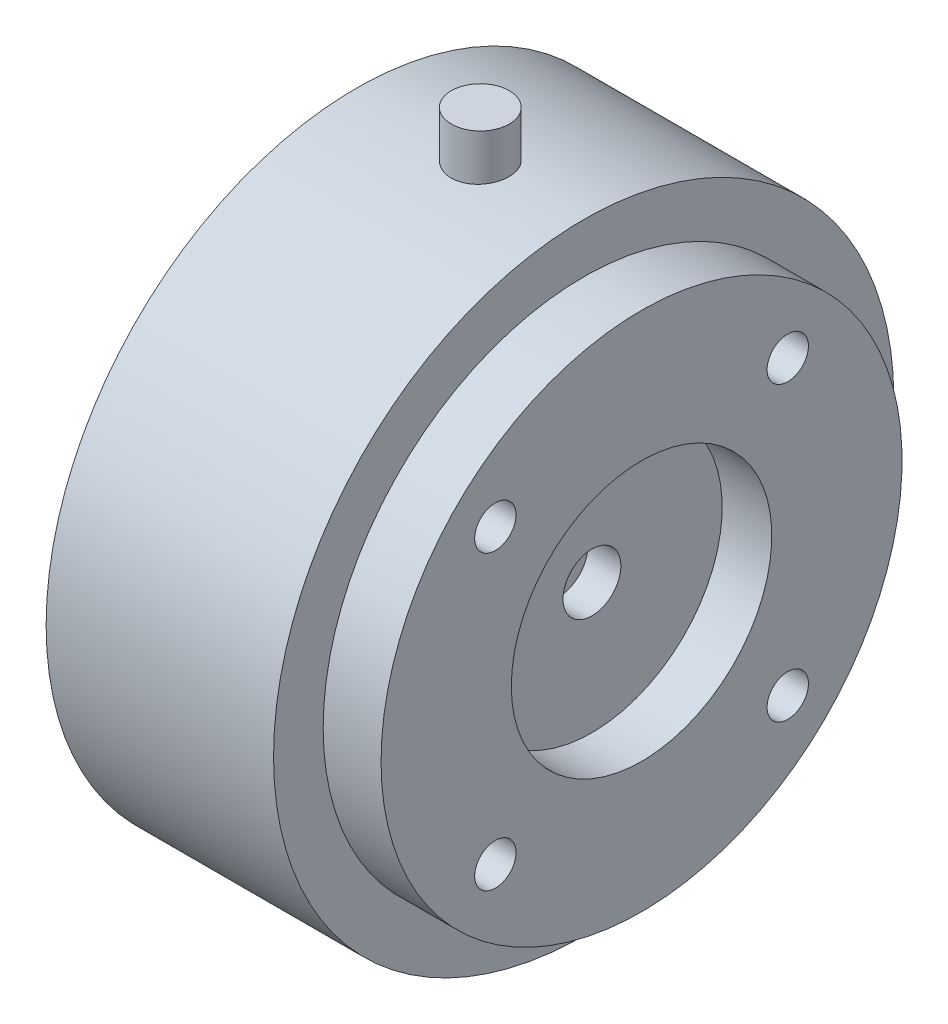
ISO-10303-21;
HEADER;
FILE_DESCRIPTION(('STEP AP214'),'2;1');
FILE_NAME('part.step','',(''),(''),'','','');
FILE_SCHEMA(('AUTOMOTIVE_DESIGN { 1 0 10303 214 1 1 1 1 }'));
ENDSEC;
DATA;
#1=APPLICATION_CONTEXT('core data for automotive mechanical design processes');
#2=APPLICATION_PROTOCOL_DEFINITION('international standard','automotive_design',2000,#1);
#3=PRODUCT_CONTEXT('',#1,'mechanical');
#4=PRODUCT('Part','Part','',(#3));
#5=PRODUCT_RELATED_PRODUCT_CATEGORY('part','',(#4));
#6=PRODUCT_DEFINITION_FORMATION('','',#4);
#7=PRODUCT_DEFINITION_CONTEXT('part definition',#1,'design');
#8=PRODUCT_DEFINITION('design','',#6,#7);
#9=PRODUCT_DEFINITION_SHAPE('','',#8);
#10=(LENGTH_UNIT() NAMED_UNIT(*) SI_UNIT(.MILLI.,.METRE.));
#11=(NAMED_UNIT(*) PLANE_ANGLE_UNIT() SI_UNIT($,.RADIAN.));
#12=(NAMED_UNIT(*) SI_UNIT($,.STERADIAN.) SOLID_ANGLE_UNIT());
#13=UNCERTAINTY_MEASURE_WITH_UNIT(LENGTH_MEASURE(1.E-05),#10,'distance_accuracy_value','');
#14=(GEOMETRIC_REPRESENTATION_CONTEXT(3) GLOBAL_UNCERTAINTY_ASSIGNED_CONTEXT((#13)) GLOBAL_UNIT_ASSIGNED_CONTEXT((#10,
#11,#12)) REPRESENTATION_CONTEXT('',''));
#15=CARTESIAN_POINT('',(0.,0.,0.));
#16=DIRECTION('',(0.,0.,1.));
#17=DIRECTION('',(1.,0.,0.));
#18=AXIS2_PLACEMENT_3D('',#15,#16,#17);
#19=CARTESIAN_POINT('',(15.,43.,0.));
#20=DIRECTION('',(0.,1.,0.));
#21=DIRECTION('',(0.,0.,1.));
#22=AXIS2_PLACEMENT_3D('',#19,#20,#21);
#23=PLANE('',#22);
#24=CARTESIAN_POINT('',(15.,43.,0.));
#25=DIRECTION('',(0.,-1.,0.));
#26=DIRECTION('',(0.,0.,-1.));
#27=AXIS2_PLACEMENT_3D('',#24,#25,#26);
#28=CIRCLE('',#27,3.5);
#29=CARTESIAN_POINT('',(15.,43.,-3.5));
#30=VERTEX_POINT('',#29);
#31=EDGE_CURVE('P0_E16',#30,#30,#28,.T.);
#32=ORIENTED_EDGE('',*,*,#31,.F.);
#33=EDGE_LOOP('',(#32));
#34=FACE_BOUND('',#33,.T.);
#35=ADVANCED_FACE('P0_F13',(#34),#23,.T.);
#36=CARTESIAN_POINT('',(15.,0.,0.));
#37=DIRECTION('',(0.,1.,0.));
#38=DIRECTION('',(0.,0.,1.));
#39=AXIS2_PLACEMENT_3D('',#36,#37,#38);
#40=PLANE('',#39);
#41=CARTESIAN_POINT('',(15.,0.,0.));
#42=DIRECTION('',(0.,-1.,0.));
#43=DIRECTION('',(0.,0.,-1.));
#44=AXIS2_PLACEMENT_3D('',#41,#42,#43);
#45=CIRCLE('',#44,3.5);
#46=CARTESIAN_POINT('',(15.,0.,-3.5));
#47=VERTEX_POINT('',#46);
#48=EDGE_CURVE('P0_E9',#47,#47,#45,.F.);
#49=ORIENTED_EDGE('',*,*,#48,.F.);
#50=EDGE_LOOP('',(#49));
#51=FACE_BOUND('',#50,.T.);
#52=ADVANCED_FACE('P0_F28',(#51),#40,.F.);
#53=CARTESIAN_POINT('',(15.,43.,0.));
#54=DIRECTION('',(0.,-1.,0.));
#55=DIRECTION('',(0.,0.,-1.));
#56=AXIS2_PLACEMENT_3D('',#53,#54,#55);
#57=CYLINDRICAL_SURFACE('',#56,3.5);
#58=ORIENTED_EDGE('',*,*,#48,.T.);
#59=EDGE_LOOP('',(#58));
#60=FACE_BOUND('',#59,.T.);
#61=ORIENTED_EDGE('',*,*,#31,.T.);
#62=EDGE_LOOP('',(#61));
#63=FACE_BOUND('',#62,.T.);
#64=ADVANCED_FACE('P0_F25',(#60,#63),#57,.T.);
#65=CLOSED_SHELL('',(#35,#52,#64));
#66=MANIFOLD_SOLID_BREP('P0_B1',#65);
#67=CARTESIAN_POINT('',(24.5,0.,0.));
#68=DIRECTION('',(1.,0.,0.));
#69=DIRECTION('',(0.,0.,-1.));
#70=AXIS2_PLACEMENT_3D('',#67,#68,#69);
#71=PLANE('',#70);
#72=CARTESIAN_POINT('',(24.5,0.,0.));
#73=DIRECTION('',(1.,0.,0.));
#74=DIRECTION('',(0.,0.,-1.));
#75=AXIS2_PLACEMENT_3D('',#72,#73,#74);
#76=CIRCLE('',#75,3.5);
#77=CARTESIAN_POINT('',(24.5,0.,-3.5));
#78=VERTEX_POINT('',#77);
#79=EDGE_CURVE('P1_E198',#78,#78,#76,.T.);
#80=ORIENTED_EDGE('',*,*,#79,.T.);
#81=EDGE_LOOP('',(#80));
#82=FACE_BOUND('',#81,.T.);
#83=ADVANCED_FACE('P1_F17',(#82),#71,.T.);
#84=CARTESIAN_POINT('',(0.,0.,0.));
#85=DIRECTION('',(1.,0.,0.));
#86=DIRECTION('',(0.,0.,-1.));
#87=AXIS2_PLACEMENT_3D('',#84,#85,#86);
#88=CYLINDRICAL_SURFACE('',#87,3.5);
#89=ORIENTED_EDGE('',*,*,#79,.F.);
#90=EDGE_LOOP('',(#89));
#91=FACE_BOUND('',#90,.T.);
#92=CARTESIAN_POINT('',(28.5,0.,0.));
#93=DIRECTION('',(1.,0.,0.));
#94=DIRECTION('',(0.,0.,-1.));
#95=AXIS2_PLACEMENT_3D('',#92,#93,#94);
#96=CIRCLE('',#95,3.5);
#97=CARTESIAN_POINT('',(28.5,0.,-3.5));
#98=VERTEX_POINT('',#97);
#99=EDGE_CURVE('P1_E85',#98,#98,#96,.T.);
#100=ORIENTED_EDGE('',*,*,#99,.T.);
#101=EDGE_LOOP('',(#100));
#102=FACE_BOUND('',#101,.T.);
#103=ADVANCED_FACE('P1_F188',(#91,#102),#88,.F.);
#104=CARTESIAN_POINT('',(26.4999999999418,-17.6776695296635,-17.6776695296638));
#105=DIRECTION('',(1.,0.,0.));
#106=DIRECTION('',(0.,0.,-1.));
#107=AXIS2_PLACEMENT_3D('',#104,#105,#106);
#108=CONICAL_SURFACE('',#107,2.49999999996645,1.02974425867857);
#109=CARTESIAN_POINT('',(24.9978484524149,-17.6776695296635,-17.6776695296638));
#110=VERTEX_POINT('',#109);
#111=VERTEX_LOOP('',#110);
#112=FACE_BOUND('',#111,.T.);
#113=CARTESIAN_POINT('',(26.5,-17.6776695296635,-17.6776695296638));
#114=DIRECTION('',(1.,0.,0.));
#115=DIRECTION('',(0.,0.,-1.));
#116=AXIS2_PLACEMENT_3D('',#113,#114,#115);
#117=CIRCLE('',#116,2.5);
#118=CARTESIAN_POINT('',(26.5,-17.6776695296635,-20.1776695296638));
#119=VERTEX_POINT('',#118);
#120=EDGE_CURVE('P1_E83',#119,#119,#117,.T.);
#121=ORIENTED_EDGE('',*,*,#120,.T.);
#122=EDGE_LOOP('',(#121));
#123=FACE_BOUND('',#122,.T.);
#124=ADVANCED_FACE('P1_F186',(#112,#123),#108,.F.);
#125=CARTESIAN_POINT('',(26.4999999999986,-17.6776695296638,17.6776695296636));
#126=DIRECTION('',(1.,0.,0.));
#127=DIRECTION('',(0.,1.,0.));
#128=AXIS2_PLACEMENT_3D('',#125,#126,#127);
#129=CONICAL_SURFACE('',#128,2.50000000002875,1.0297442586719);
#130=CARTESIAN_POINT('',(24.9978484524149,-17.6776695296638,17.6776695296636));
#131=VERTEX_POINT('',#130);
#132=VERTEX_LOOP('',#131);
#133=FACE_BOUND('',#132,.T.);
#134=CARTESIAN_POINT('',(26.5,-17.6776695296638,17.6776695296636));
#135=DIRECTION('',(1.,0.,0.));
#136=DIRECTION('',(0.,0.,-1.));
#137=AXIS2_PLACEMENT_3D('',#134,#135,#136);
#138=CIRCLE('',#137,2.5);
#139=CARTESIAN_POINT('',(26.5,-17.6776695296638,15.1776695296636));
#140=VERTEX_POINT('',#139);
#141=EDGE_CURVE('P1_E80',#140,#140,#138,.T.);
#142=ORIENTED_EDGE('',*,*,#141,.T.);
#143=EDGE_LOOP('',(#142));
#144=FACE_BOUND('',#143,.T.);
#145=ADVANCED_FACE('P1_F182',(#133,#144),#129,.F.);
#146=CARTESIAN_POINT('',(26.4999999999986,17.6776695296637,17.6776695296637));
#147=DIRECTION('',(1.,0.,0.));
#148=DIRECTION('',(0.,1.,0.));
#149=AXIS2_PLACEMENT_3D('',#146,#147,#148);
#150=CONICAL_SURFACE('',#149,2.50000000002888,1.0297442586719);
#151=CARTESIAN_POINT('',(24.9978484524149,17.6776695296637,17.6776695296637));
#152=VERTEX_POINT('',#151);
#153=VERTEX_LOOP('',#152);
#154=FACE_BOUND('',#153,.T.);
#155=CARTESIAN_POINT('',(26.5,17.6776695296637,17.6776695296637));
#156=DIRECTION('',(1.,0.,0.));
#157=DIRECTION('',(0.,0.,-1.));
#158=AXIS2_PLACEMENT_3D('',#155,#156,#157);
#159=CIRCLE('',#158,2.5);
#160=CARTESIAN_POINT('',(26.5,17.6776695296637,15.1776695296637));
#161=VERTEX_POINT('',#160);
#162=EDGE_CURVE('P1_E77',#161,#161,#159,.T.);
#163=ORIENTED_EDGE('',*,*,#162,.T.);
#164=EDGE_LOOP('',(#163));
#165=FACE_BOUND('',#164,.T.);
#166=ADVANCED_FACE('P1_F179',(#154,#165),#150,.F.);
#167=CARTESIAN_POINT('',(26.4999999999418,17.6776695296637,-17.6776695296637));
#168=DIRECTION('',(1.,0.,0.));
#169=DIRECTION('',(0.,0.,-1.));
#170=AXIS2_PLACEMENT_3D('',#167,#168,#169);
#171=CONICAL_SURFACE('',#170,2.49999999996657,1.02974425867857);
#172=CARTESIAN_POINT('',(24.9978484524149,17.6776695296637,-17.6776695296637));
#173=VERTEX_POINT('',#172);
#174=VERTEX_LOOP('',#173);
#175=FACE_BOUND('',#174,.T.);
#176=CARTESIAN_POINT('',(26.5,17.6776695296637,-17.6776695296637));
#177=DIRECTION('',(1.,0.,0.));
#178=DIRECTION('',(0.,0.,-1.));
#179=AXIS2_PLACEMENT_3D('',#176,#177,#178);
#180=CIRCLE('',#179,2.5);
#181=CARTESIAN_POINT('',(26.5,17.6776695296637,-20.1776695296637));
#182=VERTEX_POINT('',#181);
#183=EDGE_CURVE('P1_E73',#182,#182,#180,.T.);
#184=ORIENTED_EDGE('',*,*,#183,.T.);
#185=EDGE_LOOP('',(#184));
#186=FACE_BOUND('',#185,.T.);
#187=ADVANCED_FACE('P1_F175',(#175,#186),#171,.F.);
#188=CARTESIAN_POINT('',(28.5,15.75,0.));
#189=DIRECTION('',(-1.,0.,0.));
#190=DIRECTION('',(0.,0.,1.));
#191=AXIS2_PLACEMENT_3D('',#188,#189,#190);
#192=PLANE('',#191);
#193=CARTESIAN_POINT('',(28.5,0.,0.));
#194=DIRECTION('',(-1.,0.,0.));
#195=DIRECTION('',(0.,0.,1.));
#196=AXIS2_PLACEMENT_3D('',#193,#194,#195);
#197=CIRCLE('',#196,15.75);
#198=CARTESIAN_POINT('',(28.5,0.,15.75));
#199=VERTEX_POINT('',#198);
#200=EDGE_CURVE('P1_E76',#199,#199,#197,.F.);
#201=ORIENTED_EDGE('',*,*,#200,.T.);
#202=EDGE_LOOP('',(#201));
#203=FACE_BOUND('',#202,.T.);
#204=ORIENTED_EDGE('',*,*,#99,.F.);
#205=EDGE_LOOP('',(#204));
#206=FACE_BOUND('',#205,.T.);
#207=ADVANCED_FACE('P1_F171',(#203,#206),#192,.F.);
#208=CARTESIAN_POINT('',(34.5,-17.6776695296635,-17.6776695296638));
#209=DIRECTION('',(1.,0.,0.));
#210=DIRECTION('',(0.,0.,-1.));
#211=AXIS2_PLACEMENT_3D('',#208,#209,#210);
#212=CYLINDRICAL_SURFACE('',#211,2.5);
#213=ORIENTED_EDGE('',*,*,#120,.F.);
#214=EDGE_LOOP('',(#213));
#215=FACE_BOUND('',#214,.T.);
#216=CARTESIAN_POINT('',(34.5,-17.6776695296635,-17.6776695296638));
#217=DIRECTION('',(1.,0.,0.));
#218=DIRECTION('',(0.,0.,-1.));
#219=AXIS2_PLACEMENT_3D('',#216,#217,#218);
#220=CIRCLE('',#219,2.5);
#221=CARTESIAN_POINT('',(34.5,-17.6776695296635,-20.1776695296638));
#222=VERTEX_POINT('',#221);
#223=EDGE_CURVE('P1_E396',#222,#222,#220,.T.);
#224=ORIENTED_EDGE('',*,*,#223,.T.);
#225=EDGE_LOOP('',(#224));
#226=FACE_BOUND('',#225,.T.);
#227=ADVANCED_FACE('P1_F167',(#215,#226),#212,.F.);
#228=CARTESIAN_POINT('',(34.5,-17.6776695296638,17.6776695296636));
#229=DIRECTION('',(1.,0.,0.));
#230=DIRECTION('',(0.,0.,-1.));
#231=AXIS2_PLACEMENT_3D('',#228,#229,#230);
#232=CYLINDRICAL_SURFACE('',#231,2.5);
#233=ORIENTED_EDGE('',*,*,#141,.F.);
#234=EDGE_LOOP('',(#233));
#235=FACE_BOUND('',#234,.T.);
#236=CARTESIAN_POINT('',(34.5,-17.6776695296638,17.6776695296636));
#237=DIRECTION('',(1.,0.,0.));
#238=DIRECTION('',(0.,0.,-1.));
#239=AXIS2_PLACEMENT_3D('',#236,#237,#238);
#240=CIRCLE('',#239,2.5);
#241=CARTESIAN_POINT('',(34.5,-17.6776695296638,15.1776695296636));
#242=VERTEX_POINT('',#241);
#243=EDGE_CURVE('P1_E393',#242,#242,#240,.T.);
#244=ORIENTED_EDGE('',*,*,#243,.T.);
#245=EDGE_LOOP('',(#244));
#246=FACE_BOUND('',#245,.T.);
#247=ADVANCED_FACE('P1_F163',(#235,#246),#232,.F.);
#248=CARTESIAN_POINT('',(34.5,17.6776695296637,17.6776695296637));
#249=DIRECTION('',(1.,0.,0.));
#250=DIRECTION('',(0.,0.,-1.));
#251=AXIS2_PLACEMENT_3D('',#248,#249,#250);
#252=CYLINDRICAL_SURFACE('',#251,2.5);
#253=ORIENTED_EDGE('',*,*,#162,.F.);
#254=EDGE_LOOP('',(#253));
#255=FACE_BOUND('',#254,.T.);
#256=CARTESIAN_POINT('',(34.5,17.6776695296637,17.6776695296637));
#257=DIRECTION('',(1.,0.,0.));
#258=DIRECTION('',(0.,0.,-1.));
#259=AXIS2_PLACEMENT_3D('',#256,#257,#258);
#260=CIRCLE('',#259,2.5);
#261=CARTESIAN_POINT('',(34.5,17.6776695296637,15.1776695296637));
#262=VERTEX_POINT('',#261);
#263=EDGE_CURVE('P1_E389',#262,#262,#260,.T.);
#264=ORIENTED_EDGE('',*,*,#263,.T.);
#265=EDGE_LOOP('',(#264));
#266=FACE_BOUND('',#265,.T.);
#267=ADVANCED_FACE('P1_F159',(#255,#266),#252,.F.);
#268=CARTESIAN_POINT('',(34.5,17.6776695296637,-17.6776695296637));
#269=DIRECTION('',(1.,0.,0.));
#270=DIRECTION('',(0.,0.,-1.));
#271=AXIS2_PLACEMENT_3D('',#268,#269,#270);
#272=CYLINDRICAL_SURFACE('',#271,2.5);
#273=ORIENTED_EDGE('',*,*,#183,.F.);
#274=EDGE_LOOP('',(#273));
#275=FACE_BOUND('',#274,.T.);
#276=CARTESIAN_POINT('',(34.5,17.6776695296637,-17.6776695296637));
#277=DIRECTION('',(1.,0.,0.));
#278=DIRECTION('',(0.,0.,-1.));
#279=AXIS2_PLACEMENT_3D('',#276,#277,#278);
#280=CIRCLE('',#279,2.5);
#281=CARTESIAN_POINT('',(34.5,17.6776695296637,-20.1776695296637));
#282=VERTEX_POINT('',#281);
#283=EDGE_CURVE('P1_E385',#282,#282,#280,.T.);
#284=ORIENTED_EDGE('',*,*,#283,.T.);
#285=EDGE_LOOP('',(#284));
#286=FACE_BOUND('',#285,.T.);
#287=ADVANCED_FACE('P1_F155',(#275,#286),#272,.F.);
#288=CARTESIAN_POINT('',(0.,0.,0.));
#289=DIRECTION('',(-1.,0.,0.));
#290=DIRECTION('',(0.,0.,1.));
#291=AXIS2_PLACEMENT_3D('',#288,#289,#290);
#292=CYLINDRICAL_SURFACE('',#291,15.75);
#293=CARTESIAN_POINT('',(34.5,0.,0.));
#294=DIRECTION('',(-1.,0.,0.));
#295=DIRECTION('',(0.,0.,1.));
#296=AXIS2_PLACEMENT_3D('',#293,#294,#295);
#297=CIRCLE('',#296,15.75);
#298=CARTESIAN_POINT('',(34.5,0.,15.75));
#299=VERTEX_POINT('',#298);
#300=EDGE_CURVE('P1_E138',#299,#299,#297,.F.);
#301=ORIENTED_EDGE('',*,*,#300,.T.);
#302=EDGE_LOOP('',(#301));
#303=FACE_BOUND('',#302,.T.);
#304=ORIENTED_EDGE('',*,*,#200,.F.);
#305=EDGE_LOOP('',(#304));
#306=FACE_BOUND('',#305,.T.);
#307=ADVANCED_FACE('P1_F151',(#303,#306),#292,.F.);
#308=CARTESIAN_POINT('',(34.5,31.5,0.));
#309=DIRECTION('',(-1.,0.,0.));
#310=DIRECTION('',(0.,0.,1.));
#311=AXIS2_PLACEMENT_3D('',#308,#309,#310);
#312=PLANE('',#311);
#313=ORIENTED_EDGE('',*,*,#300,.F.);
#314=EDGE_LOOP('',(#313));
#315=FACE_BOUND('',#314,.T.);
#316=CARTESIAN_POINT('',(34.5,0.,0.));
#317=DIRECTION('',(-1.,0.,0.));
#318=DIRECTION('',(0.,0.,1.));
#319=AXIS2_PLACEMENT_3D('',#316,#317,#318);
#320=CIRCLE('',#319,31.5);
#321=CARTESIAN_POINT('',(34.5,0.,31.5));
#322=VERTEX_POINT('',#321);
#323=EDGE_CURVE('P1_E135',#322,#322,#320,.T.);
#324=ORIENTED_EDGE('',*,*,#323,.F.);
#325=EDGE_LOOP('',(#324));
#326=FACE_BOUND('',#325,.T.);
#327=ORIENTED_EDGE('',*,*,#283,.F.);
#328=EDGE_LOOP('',(#327));
#329=FACE_BOUND('',#328,.T.);
#330=ORIENTED_EDGE('',*,*,#263,.F.);
#331=EDGE_LOOP('',(#330));
#332=FACE_BOUND('',#331,.T.);
#333=ORIENTED_EDGE('',*,*,#243,.F.);
#334=EDGE_LOOP('',(#333));
#335=FACE_BOUND('',#334,.T.);
#336=ORIENTED_EDGE('',*,*,#223,.F.);
#337=EDGE_LOOP('',(#336));
#338=FACE_BOUND('',#337,.T.);
#339=ADVANCED_FACE('P1_F148',(#315,#326,#329,#332,#335,#338),#312,.F.);
#340=CARTESIAN_POINT('',(110.767027304759,0.,0.));
#341=DIRECTION('',(-1.,0.,0.));
#342=DIRECTION('',(0.,0.,1.));
#343=AXIS2_PLACEMENT_3D('',#340,#341,#342);
#344=CYLINDRICAL_SURFACE('',#343,30.5);
#345=CARTESIAN_POINT('',(15.,30.2985148150862,3.5));
#346=CARTESIAN_POINT('',(15.1957241918327,30.298517378201,3.49999145726934));
#347=CARTESIAN_POINT('',(15.391706129943,30.3004332540409,3.48351415691752));
#348=CARTESIAN_POINT('',(15.7783592301681,30.3078916885357,3.41800360986984));
#349=CARTESIAN_POINT('',(15.9690184270781,30.3134418242641,3.3689023422705));
#350=CARTESIAN_POINT('',(16.3391717964097,30.3275322944483,3.23959657868739));
#351=CARTESIAN_POINT('',(16.5186773197242,30.3360695282893,3.15942432520621));
#352=CARTESIAN_POINT('',(16.8616010791098,30.3551677477307,2.97031612135552));
#353=CARTESIAN_POINT('',(17.0250261007644,30.3657278741277,2.86139237549709));
#354=CARTESIAN_POINT('',(17.3320316611392,30.3877407639857,2.61729800992369));
#355=CARTESIAN_POINT('',(17.4755233500652,30.3991971892655,2.48201595110769));
#356=CARTESIAN_POINT('',(17.737825696396,30.4216792291987,2.18927848624548));
#357=CARTESIAN_POINT('',(17.856633951149,30.4327048018289,2.03182092416669));
#358=CARTESIAN_POINT('',(18.066493529691,30.4531181691266,1.69866981088559));
#359=CARTESIAN_POINT('',(18.1574674419035,30.4625013656716,1.52292719050938));
#360=CARTESIAN_POINT('',(18.3085792035095,30.4785337357317,1.15853524249233));
#361=CARTESIAN_POINT('',(18.3687182945705,30.4851830193348,0.969886434909223));
#362=CARTESIAN_POINT('',(18.4561968809372,30.4949733208849,0.585919982397345));
#363=CARTESIAN_POINT('',(18.483680109644,30.498129708417,0.390635482220919));
#364=CARTESIAN_POINT('',(18.5055119415603,30.5006309800531,-0.00179814922138461));
#365=CARTESIAN_POINT('',(18.4998615965257,30.4999759851414,-0.198947221102005));
#366=CARTESIAN_POINT('',(18.4557026022766,30.4949407964535,-0.588534530467278));
#367=CARTESIAN_POINT('',(18.4173488190871,30.4905781604075,-0.780990580505136));
#368=CARTESIAN_POINT('',(18.309112802447,30.4786377272088,-1.15671787386288));
#369=CARTESIAN_POINT('',(18.2392297691636,30.4710598484922,-1.33998888404597));
#370=CARTESIAN_POINT('',(18.0697493194626,30.4535100495338,-1.69263095242608));
#371=CARTESIAN_POINT('',(17.970083223773,30.4435326064287,-1.86196871705035));
#372=CARTESIAN_POINT('',(17.7439244415839,30.42230250347,-2.18155900020481));
#373=CARTESIAN_POINT('',(17.6174329078279,30.4110498984224,-2.33181233838803));
#374=CARTESIAN_POINT('',(17.3403704070089,30.3884551454816,-2.60986627331945));
#375=CARTESIAN_POINT('',(17.1896691856529,30.3771128480346,-2.73753708685216));
#376=CARTESIAN_POINT('',(16.8688244322086,30.3556737708395,-2.96585046369139));
#377=CARTESIAN_POINT('',(16.6986719939111,30.3455775660804,-3.06648057453254));
#378=CARTESIAN_POINT('',(16.3436015709479,30.3277726662424,-3.23784902247358));
#379=CARTESIAN_POINT('',(16.1586669763757,30.320066705763,-3.30855315570503));
#380=CARTESIAN_POINT('',(15.7796931406874,30.3079568417157,-3.41772073943064));
#381=CARTESIAN_POINT('',(15.5856741279069,30.3035459409147,-3.45625253020592));
#382=CARTESIAN_POINT('',(15.3252842170865,30.3001908899848,-3.48546347914347));
#383=CARTESIAN_POINT('',(15.260356316206,30.2995636448211,-3.49091060261971));
#384=CARTESIAN_POINT('',(15.1302951331559,30.2987251806388,-3.49818028569412));
#385=CARTESIAN_POINT('',(15.0651618509191,30.2985139617564,-3.50000284410494));
#386=CARTESIAN_POINT('',(14.8042758081673,30.298517378201,-3.49999145726934));
#387=CARTESIAN_POINT('',(14.608293870057,30.3004332540409,-3.48351415691752));
#388=CARTESIAN_POINT('',(14.2216407698319,30.3078916885357,-3.41800360986984));
#389=CARTESIAN_POINT('',(14.0309815729219,30.3134418242641,-3.3689023422705));
#390=CARTESIAN_POINT('',(13.6608282035903,30.3275322944483,-3.23959657868739));
#391=CARTESIAN_POINT('',(13.4813226802758,30.3360695282893,-3.15942432520621));
#392=CARTESIAN_POINT('',(13.1383989208902,30.3551677477307,-2.97031612135552));
#393=CARTESIAN_POINT('',(12.9749738992356,30.3657278741277,-2.86139237549709));
#394=CARTESIAN_POINT('',(12.6679683388608,30.3877407639857,-2.61729800992369));
#395=CARTESIAN_POINT('',(12.5244766499348,30.3991971892655,-2.48201595110769));
#396=CARTESIAN_POINT('',(12.262174303604,30.4216792291987,-2.18927848624548));
#397=CARTESIAN_POINT('',(12.143366048851,30.4327048018289,-2.03182092416668));
#398=CARTESIAN_POINT('',(11.933506470309,30.4531181691266,-1.69866981088558));
#399=CARTESIAN_POINT('',(11.8425325580965,30.4625013656716,-1.52292719050938));
#400=CARTESIAN_POINT('',(11.6914207964905,30.4785337357317,-1.15853524249233));
#401=CARTESIAN_POINT('',(11.6312817054295,30.4851830193348,-0.969886434909219));
#402=CARTESIAN_POINT('',(11.5438031190628,30.4949733208849,-0.58591998239734));
#403=CARTESIAN_POINT('',(11.516319890356,30.498129708417,-0.390635482220916));
#404=CARTESIAN_POINT('',(11.4944880584397,30.5006309800531,0.00179814922138805));
#405=CARTESIAN_POINT('',(11.5001384034743,30.4999759851414,0.198947221102009));
#406=CARTESIAN_POINT('',(11.5442973977234,30.4949407964535,0.588534530467283));
#407=CARTESIAN_POINT('',(11.5826511809129,30.4905781604075,0.780990580505141));
#408=CARTESIAN_POINT('',(11.690887197553,30.4786377272088,1.15671787386288));
#409=CARTESIAN_POINT('',(11.7607702308364,30.4710598484922,1.33998888404597));
#410=CARTESIAN_POINT('',(11.9302506805374,30.4535100495338,1.69263095242609));
#411=CARTESIAN_POINT('',(12.029916776227,30.4435326064287,1.86196871705036));
#412=CARTESIAN_POINT('',(12.2560755584161,30.42230250347,2.18155900020481));
#413=CARTESIAN_POINT('',(12.3825670921721,30.4110498984224,2.33181233838803));
#414=CARTESIAN_POINT('',(12.6596295929911,30.3884551454816,2.60986627331945));
#415=CARTESIAN_POINT('',(12.8103308143471,30.3771128480346,2.73753708685217));
#416=CARTESIAN_POINT('',(13.1311755677914,30.3556737708395,2.96585046369139));
#417=CARTESIAN_POINT('',(13.3013280060889,30.3455775660804,3.06648057453255));
#418=CARTESIAN_POINT('',(13.6563984290521,30.3277726662424,3.23784902247358));
#419=CARTESIAN_POINT('',(13.8413330236243,30.320066705763,3.30855315570503));
#420=CARTESIAN_POINT('',(14.2203068593126,30.3079568417157,3.41772073943064));
#421=CARTESIAN_POINT('',(14.4143258720931,30.3035459409147,3.45625253020592));
#422=CARTESIAN_POINT('',(14.6747157829135,30.3001908899848,3.48546347914347));
#423=CARTESIAN_POINT('',(14.739643683794,30.2995636448211,3.49091060261971));
#424=CARTESIAN_POINT('',(14.8697048668441,30.2987251806388,3.49818028569412));
#425=CARTESIAN_POINT('',(14.9348381490809,30.2985139617564,3.50000284410494));
#426=CARTESIAN_POINT('',(15.,30.2985148150862,3.5));
#427=B_SPLINE_CURVE_WITH_KNOTS('',3,(#345,#346,#347,#348,#349,#350,#351,#352,#353,#354,#355,
#356,#357,#358,#359,#360,#361,#362,#363,#364,#365,#366,#367,#368,#369,#370,#371,#372,#373,#374,
#375,#376,#377,#378,#379,#380,#381,#382,#383,#384,#385,#386,#387,#388,#389,#390,#391,#392,#393,
#394,#395,#396,#397,#398,#399,#400,#401,#402,#403,#404,#405,#406,#407,#408,#409,#410,#411,#412,
#413,#414,#415,#416,#417,#418,#419,#420,#421,#422,#423,#424,#425,#426),.UNSPECIFIED.,.T.,.F.,(4,
2,2,2,2,2,2,2,2,2,2,2,2,2,2,2,2,2,2,2,2,2,2,2,2,2,2,2,2,2,2,2,2,2,2,2,2,2,2,2,4),(0.,
0.586924300188882,1.17507619265082,1.76261938441853,2.34991357422254,2.93974685655111,
3.52963752557404,4.12115416296189,4.71264697907599,5.301526605123,5.89038753852025,
6.47647532939776,7.06257798896397,7.65004276072638,8.2374822930495,8.82819532080954,
9.41917991237897,10.010838157074,10.6012363845076,10.7966392157223,10.9920421109474,
11.5789664111363,12.1671183035983,12.754661495366,13.34195568517,13.9317889674986,
14.5216796365215,15.1131962739093,15.7046890900234,16.2935687160704,16.8824296494677,
17.4685174403452,18.0546200999114,18.6420848716738,19.229524403997,19.820237431757,
20.4112220233264,21.0028802680215,21.593278495455,21.7886813266698,21.9840842218949),.UNSPECIFIED.);
#428=CARTESIAN_POINT('',(15.,30.2985148150862,3.5));
#429=VERTEX_POINT('',#428);
#430=EDGE_CURVE('P1_E133',#429,#429,#427,.T.);
#431=ORIENTED_EDGE('',*,*,#430,.T.);
#432=EDGE_LOOP('',(#431));
#433=FACE_BOUND('',#432,.T.);
#434=ADVANCED_FACE('P1_F144',(#433),#344,.T.);
#435=CARTESIAN_POINT('',(0.,0.,0.));
#436=DIRECTION('',(-1.,0.,0.));
#437=DIRECTION('',(0.,0.,1.));
#438=AXIS2_PLACEMENT_3D('',#435,#436,#437);
#439=CYLINDRICAL_SURFACE('',#438,31.5);
#440=CARTESIAN_POINT('',(27.5,0.,0.));
#441=DIRECTION('',(-1.,0.,0.));
#442=DIRECTION('',(0.,0.,1.));
#443=AXIS2_PLACEMENT_3D('',#440,#441,#442);
#444=CIRCLE('',#443,31.5);
#445=CARTESIAN_POINT('',(27.5,0.,31.5));
#446=VERTEX_POINT('',#445);
#447=EDGE_CURVE('P1_E96',#446,#446,#444,.F.);
#448=ORIENTED_EDGE('',*,*,#447,.T.);
#449=EDGE_LOOP('',(#448));
#450=FACE_BOUND('',#449,.T.);
#451=ORIENTED_EDGE('',*,*,#323,.T.);
#452=EDGE_LOOP('',(#451));
#453=FACE_BOUND('',#452,.T.);
#454=ADVANCED_FACE('P1_F116',(#450,#453),#439,.T.);
#455=CARTESIAN_POINT('',(15.,37.5,0.));
#456=DIRECTION('',(0.,-1.,0.));
#457=DIRECTION('',(0.,0.,-1.));
#458=AXIS2_PLACEMENT_3D('',#455,#456,#457);
#459=CYLINDRICAL_SURFACE('',#458,3.5);
#460=CARTESIAN_POINT('',(15.,37.3363094051889,-3.5));
#461=CARTESIAN_POINT('',(15.1959643453164,37.3363114581779,-3.49999159976147));
#462=CARTESIAN_POINT('',(15.3921891489186,37.3378699743436,-3.48347414309542));
#463=CARTESIAN_POINT('',(15.7793337680521,37.3439381541415,-3.41779635529493));
#464=CARTESIAN_POINT('',(15.9702415229039,37.3484540346556,-3.36856725553234));
#465=CARTESIAN_POINT('',(16.3408952418815,37.3599213532937,-3.23890177151375));
#466=CARTESIAN_POINT('',(16.5206518150099,37.3668704333545,-3.1584955935267));
#467=CARTESIAN_POINT('',(16.864029437843,37.3824176383386,-2.96881481261273));
#468=CARTESIAN_POINT('',(17.0276575581212,37.3910150357417,-2.85955293776334));
#469=CARTESIAN_POINT('',(17.3347650593464,37.4089230033886,-2.61486659417071));
#470=CARTESIAN_POINT('',(17.4781841383579,37.4182355850682,-2.47936657463364));
#471=CARTESIAN_POINT('',(17.7402867663997,37.4365066736323,-2.1862053535238));
#472=CARTESIAN_POINT('',(17.8589680039185,37.4454651473656,-2.02854208331272));
#473=CARTESIAN_POINT('',(18.0684144585565,37.4620368979857,-1.69518417705755));
#474=CARTESIAN_POINT('',(18.1591289895445,37.4696477219285,-1.51945756287206));
#475=CARTESIAN_POINT('',(18.3097415868075,37.482645682227,-1.15518511728849));
#476=CARTESIAN_POINT('',(18.3696405836016,37.4880328857272,-0.966639673167981));
#477=CARTESIAN_POINT('',(18.4567531338866,37.4959630819518,-0.582666348263732));
#478=CARTESIAN_POINT('',(18.4840619485078,37.4985143625747,-0.38726025339446));
#479=CARTESIAN_POINT('',(18.5055135565062,37.5005134027287,0.00537773248790243));
#480=CARTESIAN_POINT('',(18.4996570485392,37.4999612276368,0.202609584952463));
#481=CARTESIAN_POINT('',(18.4550219248546,37.4958223841303,0.592651845396379));
#482=CARTESIAN_POINT('',(18.4163460460606,37.4922451852938,0.785474124760557));
#483=CARTESIAN_POINT('',(18.3073293548359,37.4824692916633,1.16188026092169));
#484=CARTESIAN_POINT('',(18.2369878867867,37.4762705425918,1.34546392635076));
#485=CARTESIAN_POINT('',(18.066520528893,37.4619321209238,1.69851073715258));
#486=CARTESIAN_POINT('',(17.9663479266554,37.4537894082822,1.86795119902822));
#487=CARTESIAN_POINT('',(17.7391046818286,37.4364782470949,2.18763883602489));
#488=CARTESIAN_POINT('',(17.612035585883,37.4273098575436,2.33788711396824));
#489=CARTESIAN_POINT('',(17.3340538177107,37.4089367108281,2.61551577028369));
#490=CARTESIAN_POINT('',(17.183056454083,37.3997319422155,2.74281135319781));
#491=CARTESIAN_POINT('',(16.8617075323251,37.3823522474711,2.97032126317762));
#492=CARTESIAN_POINT('',(16.6913470280778,37.3741778010752,3.07052299956905));
#493=CARTESIAN_POINT('',(16.3360008786559,37.359782587258,3.240987496695));
#494=CARTESIAN_POINT('',(16.1510008639054,37.3535637699405,3.31122039801249));
#495=CARTESIAN_POINT('',(15.7720166993381,37.3438123278045,3.41945593530299));
#496=CARTESIAN_POINT('',(15.5780525475599,37.3402740034854,3.45752697663121));
#497=CARTESIAN_POINT('',(15.3190028707598,37.3376175073627,3.48602054515327));
#498=CARTESIAN_POINT('',(15.2553235097574,37.3371279469485,3.49125901470397));
#499=CARTESIAN_POINT('',(15.1277719971511,37.3364735611131,3.49825011202207));
#500=CARTESIAN_POINT('',(15.0638998455113,37.3363087357525,3.50000273914085));
#501=CARTESIAN_POINT('',(14.8040356546836,37.3363114581779,3.49999159976147));
#502=CARTESIAN_POINT('',(14.6078108510814,37.3378699743436,3.48347414309542));
#503=CARTESIAN_POINT('',(14.2206662319479,37.3439381541415,3.41779635529493));
#504=CARTESIAN_POINT('',(14.0297584770961,37.3484540346556,3.36856725553234));
#505=CARTESIAN_POINT('',(13.6591047581185,37.3599213532937,3.23890177151375));
#506=CARTESIAN_POINT('',(13.4793481849901,37.3668704333545,3.1584955935267));
#507=CARTESIAN_POINT('',(13.135970562157,37.3824176383386,2.96881481261273));
#508=CARTESIAN_POINT('',(12.9723424418788,37.3910150357417,2.85955293776334));
#509=CARTESIAN_POINT('',(12.6652349406536,37.4089230033886,2.61486659417071));
#510=CARTESIAN_POINT('',(12.5218158616421,37.4182355850682,2.47936657463364));
#511=CARTESIAN_POINT('',(12.2597132336003,37.4365066736323,2.1862053535238));
#512=CARTESIAN_POINT('',(12.1410319960815,37.4454651473656,2.02854208331272));
#513=CARTESIAN_POINT('',(11.9315855414435,37.4620368979857,1.69518417705755));
#514=CARTESIAN_POINT('',(11.8408710104555,37.4696477219284,1.51945756287206));
#515=CARTESIAN_POINT('',(11.6902584131925,37.482645682227,1.15518511728848));
#516=CARTESIAN_POINT('',(11.6303594163984,37.4880328857272,0.966639673167978));
#517=CARTESIAN_POINT('',(11.5432468661134,37.4959630819518,0.58266634826373));
#518=CARTESIAN_POINT('',(11.5159380514922,37.4985143625747,0.387260253394458));
#519=CARTESIAN_POINT('',(11.4944864434938,37.5005134027287,-0.00537773248790338));
#520=CARTESIAN_POINT('',(11.5003429514608,37.4999612276368,-0.202609584952464));
#521=CARTESIAN_POINT('',(11.5449780751454,37.4958223841303,-0.59265184539638));
#522=CARTESIAN_POINT('',(11.5836539539394,37.4922451852938,-0.785474124760559));
#523=CARTESIAN_POINT('',(11.6926706451641,37.4824692916633,-1.16188026092169));
#524=CARTESIAN_POINT('',(11.7630121132133,37.4762705425918,-1.34546392635076));
#525=CARTESIAN_POINT('',(11.933479471107,37.4619321209238,-1.69851073715258));
#526=CARTESIAN_POINT('',(12.0336520733446,37.4537894082822,-1.86795119902822));
#527=CARTESIAN_POINT('',(12.2608953181714,37.4364782470949,-2.1876388360249));
#528=CARTESIAN_POINT('',(12.387964414117,37.4273098575436,-2.33788711396824));
#529=CARTESIAN_POINT('',(12.6659461822893,37.4089367108281,-2.61551577028369));
#530=CARTESIAN_POINT('',(12.816943545917,37.3997319422155,-2.74281135319781));
#531=CARTESIAN_POINT('',(13.1382924676749,37.3823522474711,-2.97032126317762));
#532=CARTESIAN_POINT('',(13.3086529719222,37.3741778010752,-3.07052299956905));
#533=CARTESIAN_POINT('',(13.6639991213441,37.359782587258,-3.240987496695));
#534=CARTESIAN_POINT('',(13.8489991360946,37.3535637699405,-3.3112203980125));
#535=CARTESIAN_POINT('',(14.2279833006619,37.3438123278045,-3.419455935303));
#536=CARTESIAN_POINT('',(14.4219474524401,37.3402740034854,-3.45752697663121));
#537=CARTESIAN_POINT('',(14.6809971292402,37.3376175073627,-3.48602054515327));
#538=CARTESIAN_POINT('',(14.7446764902426,37.3371279469485,-3.49125901470397));
#539=CARTESIAN_POINT('',(14.8722280028489,37.3364735611131,-3.49825011202207));
#540=CARTESIAN_POINT('',(14.9361001544887,37.3363087357525,-3.50000273914085));
#541=CARTESIAN_POINT('',(15.,37.3363094051889,-3.5));
#542=B_SPLINE_CURVE_WITH_KNOTS('',3,(#460,#461,#462,#463,#464,#465,#466,#467,#468,#469,#470,
#471,#472,#473,#474,#475,#476,#477,#478,#479,#480,#481,#482,#483,#484,#485,#486,#487,#488,#489,
#490,#491,#492,#493,#494,#495,#496,#497,#498,#499,#500,#501,#502,#503,#504,#505,#506,#507,#508,
#509,#510,#511,#512,#513,#514,#515,#516,#517,#518,#519,#520,#521,#522,#523,#524,#525,#526,#527,
#528,#529,#530,#531,#532,#533,#534,#535,#536,#537,#538,#539,#540,#541),.UNSPECIFIED.,.T.,.F.,(4,
2,2,2,2,2,2,2,2,2,2,2,2,2,2,2,2,2,2,2,2,2,2,2,2,2,2,2,2,2,2,2,2,2,2,2,2,2,2,2,4),(0.,
0.587649724148832,1.17653877041978,1.76485868472882,2.35291952676917,2.94269952541401,
3.53253460860344,4.12343249304262,4.71431253342716,5.30346116721982,5.89259739013868,
6.47989617052856,7.06720711117352,7.65544259808875,8.24364426856451,8.83397632780462,
9.42458224827804,10.01577525205,10.60570765334,10.7973278153648,10.9889480130453,
11.5765977371941,12.165486783465,12.7538066977741,13.3418675398144,13.9316475384593,
14.5214826216487,15.1123805060879,15.7032605464724,16.2924091802651,16.8815454031839,
17.4688441835738,18.0561551242188,18.644390611134,19.2325922816098,19.8229243408499,
20.4135302613233,21.0047232650952,21.5946556663852,21.78627582841,21.9778960260905),.UNSPECIFIED.);
#543=CARTESIAN_POINT('',(15.,37.3363094051889,-3.5));
#544=VERTEX_POINT('',#543);
#545=EDGE_CURVE('P1_E89',#544,#544,#542,.T.);
#546=ORIENTED_EDGE('',*,*,#545,.F.);
#547=EDGE_LOOP('',(#546));
#548=FACE_BOUND('',#547,.T.);
#549=ORIENTED_EDGE('',*,*,#430,.F.);
#550=EDGE_LOOP('',(#549));
#551=FACE_BOUND('',#550,.T.);
#552=ADVANCED_FACE('P1_F98',(#548,#551),#459,.F.);
#553=CARTESIAN_POINT('',(27.5,37.5,0.));
#554=DIRECTION('',(-1.,0.,0.));
#555=DIRECTION('',(0.,0.,1.));
#556=AXIS2_PLACEMENT_3D('',#553,#554,#555);
#557=PLANE('',#556);
#558=ORIENTED_EDGE('',*,*,#447,.F.);
#559=EDGE_LOOP('',(#558));
#560=FACE_BOUND('',#559,.T.);
#561=CARTESIAN_POINT('',(27.5,0.,0.));
#562=DIRECTION('',(-1.,0.,0.));
#563=DIRECTION('',(0.,0.,1.));
#564=AXIS2_PLACEMENT_3D('',#561,#562,#563);
#565=CIRCLE('',#564,37.5);
#566=CARTESIAN_POINT('',(27.5,0.,37.5));
#567=VERTEX_POINT('',#566);
#568=EDGE_CURVE('P1_E26',#567,#567,#565,.T.);
#569=ORIENTED_EDGE('',*,*,#568,.F.);
#570=EDGE_LOOP('',(#569));
#571=FACE_BOUND('',#570,.T.);
#572=ADVANCED_FACE('P1_F107',(#560,#571),#557,.F.);
#573=CARTESIAN_POINT('',(0.,0.,0.));
#574=DIRECTION('',(-1.,0.,0.));
#575=DIRECTION('',(0.,0.,1.));
#576=AXIS2_PLACEMENT_3D('',#573,#574,#575);
#577=CYLINDRICAL_SURFACE('',#576,37.5);
#578=CARTESIAN_POINT('',(0.,0.,0.));
#579=DIRECTION('',(-1.,0.,0.));
#580=DIRECTION('',(0.,0.,1.));
#581=AXIS2_PLACEMENT_3D('',#578,#579,#580);
#582=CIRCLE('',#581,37.5);
#583=CARTESIAN_POINT('',(0.,0.,37.5));
#584=VERTEX_POINT('',#583);
#585=EDGE_CURVE('P1_E11',#584,#584,#582,.F.);
#586=ORIENTED_EDGE('',*,*,#585,.T.);
#587=EDGE_LOOP('',(#586));
#588=FACE_BOUND('',#587,.T.);
#589=ORIENTED_EDGE('',*,*,#568,.T.);
#590=EDGE_LOOP('',(#589));
#591=FACE_BOUND('',#590,.T.);
#592=ORIENTED_EDGE('',*,*,#545,.T.);
#593=EDGE_LOOP('',(#592));
#594=FACE_BOUND('',#593,.T.);
#595=ADVANCED_FACE('P1_F102',(#588,#591,#594),#577,.T.);
#596=CARTESIAN_POINT('',(0.,37.5,0.));
#597=DIRECTION('',(1.,0.,0.));
#598=DIRECTION('',(0.,0.,-1.));
#599=AXIS2_PLACEMENT_3D('',#596,#597,#598);
#600=PLANE('',#599);
#601=ORIENTED_EDGE('',*,*,#585,.F.);
#602=EDGE_LOOP('',(#601));
#603=FACE_BOUND('',#602,.T.);
#604=ADVANCED_FACE('P1_F106',(#603),#600,.F.);
#605=CLOSED_SHELL('',(#83,#103,#124,#145,#166,#187,#207,#227,#247,#267,#287,#307,#339,#434,#454,
#552,#572,#595,#604));
#606=CARTESIAN_POINT('',(33.000000000186,-22.,0.));
#607=DIRECTION('',(-1.,0.,0.));
#608=DIRECTION('',(0.,0.,1.));
#609=AXIS2_PLACEMENT_3D('',#606,#607,#608);
#610=CONICAL_SURFACE('',#609,1.24999999985675,1.0297442585949);
#611=CARTESIAN_POINT('',(33.7510757738926,-22.,-5.6843418860808E-11));
#612=VERTEX_POINT('',#611);
#613=VERTEX_LOOP('',#612);
#614=FACE_BOUND('',#613,.T.);
#615=CARTESIAN_POINT('',(33.,-22.,0.));
#616=DIRECTION('',(-1.,0.,0.));
#617=DIRECTION('',(0.,0.,1.));
#618=AXIS2_PLACEMENT_3D('',#615,#616,#617);
#619=CIRCLE('',#618,1.25);
#620=CARTESIAN_POINT('',(33.,-22.,1.25));
#621=VERTEX_POINT('',#620);
#622=EDGE_CURVE('P1_E69',#621,#621,#619,.F.);
#623=ORIENTED_EDGE('',*,*,#622,.F.);
#624=EDGE_LOOP('',(#623));
#625=FACE_BOUND('',#624,.T.);
#626=ADVANCED_FACE('P1_F240',(#614,#625),#610,.F.);
#627=CARTESIAN_POINT('',(24.5,0.,0.));
#628=DIRECTION('',(1.,0.,0.));
#629=DIRECTION('',(0.,0.,-1.));
#630=AXIS2_PLACEMENT_3D('',#627,#628,#629);
#631=PLANE('',#630);
#632=CARTESIAN_POINT('',(24.5,-22.,0.));
#633=DIRECTION('',(-1.,0.,0.));
#634=DIRECTION('',(0.,0.,1.));
#635=AXIS2_PLACEMENT_3D('',#632,#633,#634);
#636=CIRCLE('',#635,1.25);
#637=CARTESIAN_POINT('',(24.5,-22.,1.25));
#638=VERTEX_POINT('',#637);
#639=EDGE_CURVE('P1_E72',#638,#638,#636,.T.);
#640=ORIENTED_EDGE('',*,*,#639,.F.);
#641=EDGE_LOOP('',(#640));
#642=FACE_BOUND('',#641,.T.);
#643=ADVANCED_FACE('P1_F233',(#642),#631,.T.);
#644=CARTESIAN_POINT('',(24.5,-22.,0.));
#645=DIRECTION('',(-1.,0.,0.));
#646=DIRECTION('',(0.,0.,1.));
#647=AXIS2_PLACEMENT_3D('',#644,#645,#646);
#648=CYLINDRICAL_SURFACE('',#647,1.25);
#649=ORIENTED_EDGE('',*,*,#639,.T.);
#650=EDGE_LOOP('',(#649));
#651=FACE_BOUND('',#650,.T.);
#652=ORIENTED_EDGE('',*,*,#622,.T.);
#653=EDGE_LOOP('',(#652));
#654=FACE_BOUND('',#653,.T.);
#655=ADVANCED_FACE('P1_F231',(#651,#654),#648,.F.);
#656=CLOSED_SHELL('',(#626,#643,#655));
#657=CARTESIAN_POINT('',(33.0000000001291,11.0000000000001,-19.0525588832576));
#658=DIRECTION('',(-1.,0.,0.));
#659=DIRECTION('',(0.,0.,1.));
#660=AXIS2_PLACEMENT_3D('',#657,#658,#659);
#661=CONICAL_SURFACE('',#660,1.24999999988282,1.02974425845284);
#662=CARTESIAN_POINT('',(33.751075773921,11.0000000000001,-19.0525588832576));
#663=VERTEX_POINT('',#662);
#664=VERTEX_LOOP('',#663);
#665=FACE_BOUND('',#664,.T.);
#666=CARTESIAN_POINT('',(33.,11.0000000000001,-19.0525588832576));
#667=DIRECTION('',(-1.,0.,0.));
#668=DIRECTION('',(0.,0.,1.));
#669=AXIS2_PLACEMENT_3D('',#666,#667,#668);
#670=CIRCLE('',#669,1.25);
#671=CARTESIAN_POINT('',(33.,11.0000000000001,-17.8025588832576));
#672=VERTEX_POINT('',#671);
#673=EDGE_CURVE('P1_E64',#672,#672,#670,.F.);
#674=ORIENTED_EDGE('',*,*,#673,.F.);
#675=EDGE_LOOP('',(#674));
#676=FACE_BOUND('',#675,.T.);
#677=ADVANCED_FACE('P1_F216',(#665,#676),#661,.F.);
#678=CARTESIAN_POINT('',(24.5,0.,0.));
#679=DIRECTION('',(1.,0.,0.));
#680=DIRECTION('',(0.,0.,-1.));
#681=AXIS2_PLACEMENT_3D('',#678,#679,#680);
#682=PLANE('',#681);
#683=CARTESIAN_POINT('',(24.5,11.0000000000001,-19.0525588832576));
#684=DIRECTION('',(-1.,0.,0.));
#685=DIRECTION('',(0.,0.,1.));
#686=AXIS2_PLACEMENT_3D('',#683,#684,#685);
#687=CIRCLE('',#686,1.25);
#688=CARTESIAN_POINT('',(24.5,11.0000000000001,-17.8025588832576));
#689=VERTEX_POINT('',#688);
#690=EDGE_CURVE('P1_E68',#689,#689,#687,.T.);
#691=ORIENTED_EDGE('',*,*,#690,.F.);
#692=EDGE_LOOP('',(#691));
#693=FACE_BOUND('',#692,.T.);
#694=ADVANCED_FACE('P1_F214',(#693),#682,.T.);
#695=CARTESIAN_POINT('',(24.5,11.0000000000001,-19.0525588832576));
#696=DIRECTION('',(-1.,0.,0.));
#697=DIRECTION('',(0.,0.,1.));
#698=AXIS2_PLACEMENT_3D('',#695,#696,#697);
#699=CYLINDRICAL_SURFACE('',#698,1.25);
#700=ORIENTED_EDGE('',*,*,#690,.T.);
#701=EDGE_LOOP('',(#700));
#702=FACE_BOUND('',#701,.T.);
#703=ORIENTED_EDGE('',*,*,#673,.T.);
#704=EDGE_LOOP('',(#703));
#705=FACE_BOUND('',#704,.T.);
#706=ADVANCED_FACE('P1_F211',(#702,#705),#699,.F.);
#707=CLOSED_SHELL('',(#677,#694,#706));
#708=CARTESIAN_POINT('',(33.000000000186,10.9999999999998,19.0525588832577));
#709=DIRECTION('',(-1.,0.,0.));
#710=DIRECTION('',(0.,0.,1.));
#711=AXIS2_PLACEMENT_3D('',#708,#709,#710);
#712=CONICAL_SURFACE('',#711,1.24999999983055,1.02974425841592);
#713=CARTESIAN_POINT('',(33.7510757739494,10.9999999999998,19.0525588833146));
#714=VERTEX_POINT('',#713);
#715=VERTEX_LOOP('',#714);
#716=FACE_BOUND('',#715,.T.);
#717=CARTESIAN_POINT('',(33.,10.9999999999998,19.0525588832577));
#718=DIRECTION('',(-1.,0.,0.));
#719=DIRECTION('',(0.,0.,1.));
#720=AXIS2_PLACEMENT_3D('',#717,#718,#719);
#721=CIRCLE('',#720,1.25);
#722=CARTESIAN_POINT('',(33.,10.9999999999998,20.3025588832577));
#723=VERTEX_POINT('',#722);
#724=EDGE_CURVE('P1_E60',#723,#723,#721,.F.);
#725=ORIENTED_EDGE('',*,*,#724,.F.);
#726=EDGE_LOOP('',(#725));
#727=FACE_BOUND('',#726,.T.);
#728=ADVANCED_FACE('P1_F51',(#716,#727),#712,.F.);
#729=CARTESIAN_POINT('',(24.5,0.,0.));
#730=DIRECTION('',(1.,0.,0.));
#731=DIRECTION('',(0.,0.,-1.));
#732=AXIS2_PLACEMENT_3D('',#729,#730,#731);
#733=PLANE('',#732);
#734=CARTESIAN_POINT('',(24.5,10.9999999999998,19.0525588832577));
#735=DIRECTION('',(-1.,0.,0.));
#736=DIRECTION('',(0.,0.,1.));
#737=AXIS2_PLACEMENT_3D('',#734,#735,#736);
#738=CIRCLE('',#737,1.25);
#739=CARTESIAN_POINT('',(24.5,10.9999999999998,20.3025588832577));
#740=VERTEX_POINT('',#739);
#741=EDGE_CURVE('P1_E20',#740,#740,#738,.T.);
#742=ORIENTED_EDGE('',*,*,#741,.F.);
#743=EDGE_LOOP('',(#742));
#744=FACE_BOUND('',#743,.T.);
#745=ADVANCED_FACE('P1_F54',(#744),#733,.T.);
#746=CARTESIAN_POINT('',(24.5,10.9999999999998,19.0525588832577));
#747=DIRECTION('',(-1.,0.,0.));
#748=DIRECTION('',(0.,0.,1.));
#749=AXIS2_PLACEMENT_3D('',#746,#747,#748);
#750=CYLINDRICAL_SURFACE('',#749,1.25);
#751=ORIENTED_EDGE('',*,*,#741,.T.);
#752=EDGE_LOOP('',(#751));
#753=FACE_BOUND('',#752,.T.);
#754=ORIENTED_EDGE('',*,*,#724,.T.);
#755=EDGE_LOOP('',(#754));
#756=FACE_BOUND('',#755,.T.);
#757=ADVANCED_FACE('P1_F282',(#753,#756),#750,.F.);
#758=CLOSED_SHELL('',(#728,#745,#757));
#759=ORIENTED_CLOSED_SHELL('',*,#656,.T.);
#760=ORIENTED_CLOSED_SHELL('',*,#707,.T.);
#761=ORIENTED_CLOSED_SHELL('',*,#758,.T.);
#762=BREP_WITH_VOIDS('P1_B1',#605,(#759,#760,#761));
#763=ADVANCED_BREP_SHAPE_REPRESENTATION('',(#18,#66,#762),#14);
#764=SHAPE_DEFINITION_REPRESENTATION(#9,#763);
ENDSEC;
END-ISO-10303-21;
